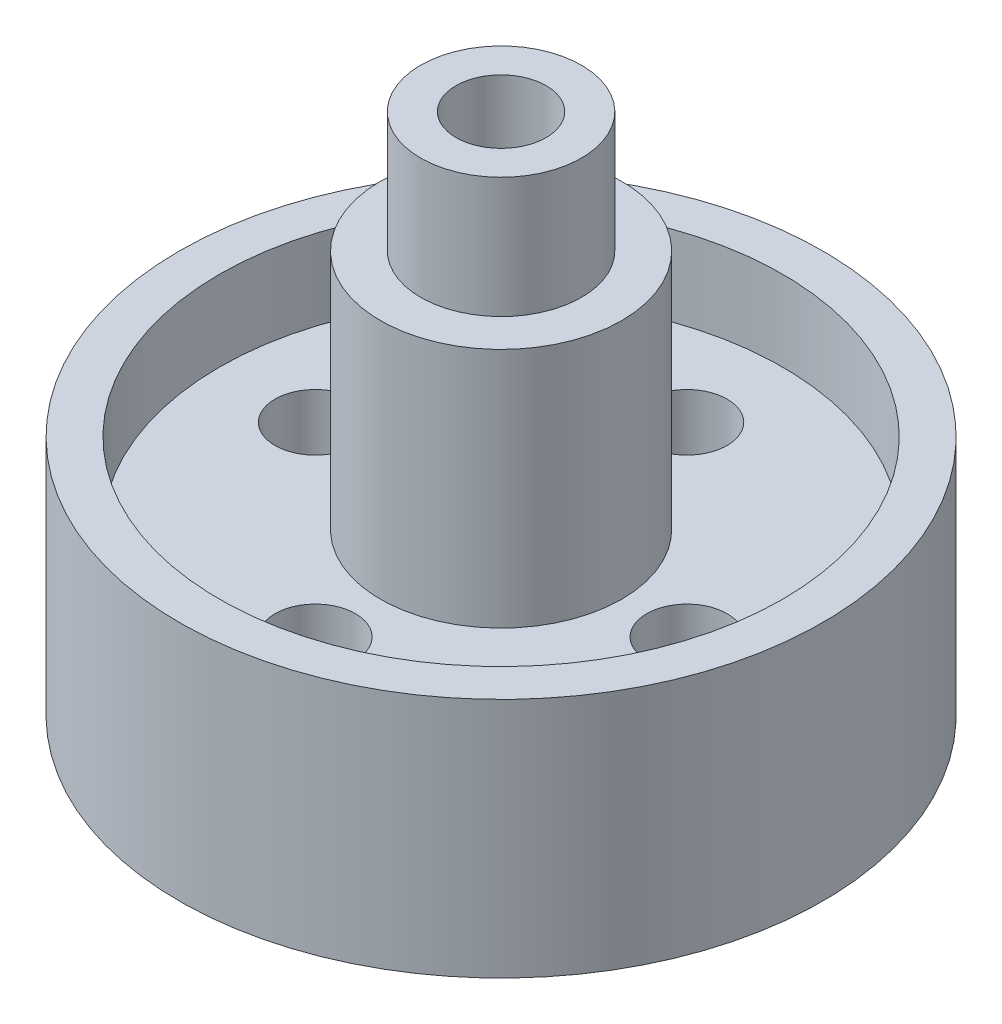
ISO-10303-21;
HEADER;
FILE_DESCRIPTION(('STEP AP214'),'2;1');
FILE_NAME('part.step','',(''),(''),'','','');
FILE_SCHEMA(('AUTOMOTIVE_DESIGN { 1 0 10303 214 1 1 1 1 }'));
ENDSEC;
DATA;
#1=APPLICATION_CONTEXT('core data for automotive mechanical design processes');
#2=APPLICATION_PROTOCOL_DEFINITION('international standard','automotive_design',2000,#1);
#3=PRODUCT_CONTEXT('',#1,'mechanical');
#4=PRODUCT('Part','Part','',(#3));
#5=PRODUCT_RELATED_PRODUCT_CATEGORY('part','',(#4));
#6=PRODUCT_DEFINITION_FORMATION('','',#4);
#7=PRODUCT_DEFINITION_CONTEXT('part definition',#1,'design');
#8=PRODUCT_DEFINITION('design','',#6,#7);
#9=PRODUCT_DEFINITION_SHAPE('','',#8);
#10=(LENGTH_UNIT() NAMED_UNIT(*) SI_UNIT(.MILLI.,.METRE.));
#11=(NAMED_UNIT(*) PLANE_ANGLE_UNIT() SI_UNIT($,.RADIAN.));
#12=(NAMED_UNIT(*) SI_UNIT($,.STERADIAN.) SOLID_ANGLE_UNIT());
#13=UNCERTAINTY_MEASURE_WITH_UNIT(LENGTH_MEASURE(1.E-05),#10,'distance_accuracy_value','');
#14=(GEOMETRIC_REPRESENTATION_CONTEXT(3) GLOBAL_UNCERTAINTY_ASSIGNED_CONTEXT((#13)) GLOBAL_UNIT_ASSIGNED_CONTEXT((#10,
#11,#12)) REPRESENTATION_CONTEXT('',''));
#15=CARTESIAN_POINT('',(0.,0.,0.));
#16=DIRECTION('',(0.,0.,1.));
#17=DIRECTION('',(1.,0.,0.));
#18=AXIS2_PLACEMENT_3D('',#15,#16,#17);
#19=CARTESIAN_POINT('',(50.8,25.4,0.));
#20=DIRECTION('',(0.,-1.,0.));
#21=DIRECTION('',(1.,0.,0.));
#22=AXIS2_PLACEMENT_3D('',#19,#20,#21);
#23=PLANE('',#22);
#24=CARTESIAN_POINT('',(0.,25.4,0.));
#25=DIRECTION('',(0.,-1.,0.));
#26=DIRECTION('',(1.,0.,0.));
#27=AXIS2_PLACEMENT_3D('',#24,#25,#26);
#28=CIRCLE('',#27,19.05);
#29=CARTESIAN_POINT('',(19.05,25.4,0.));
#30=VERTEX_POINT('',#29);
#31=EDGE_CURVE('E35',#30,#30,#28,.F.);
#32=ORIENTED_EDGE('',*,*,#31,.F.);
#33=EDGE_LOOP('',(#32));
#34=FACE_BOUND('',#33,.T.);
#35=CARTESIAN_POINT('',(3.07288764112923E-13,25.4,-29.337));
#36=DIRECTION('',(0.,1.,0.));
#37=DIRECTION('',(-1.,0.,0.));
#38=AXIS2_PLACEMENT_3D('',#35,#36,#37);
#39=CIRCLE('',#38,6.35);
#40=CARTESIAN_POINT('',(-6.3499999999997,25.4,-29.337));
#41=VERTEX_POINT('',#40);
#42=EDGE_CURVE('E60',#41,#41,#39,.T.);
#43=ORIENTED_EDGE('',*,*,#42,.F.);
#44=EDGE_LOOP('',(#43));
#45=FACE_BOUND('',#44,.T.);
#46=CARTESIAN_POINT('',(-29.337,25.4,-2.04859176075282E-13));
#47=DIRECTION('',(0.,1.,0.));
#48=DIRECTION('',(-1.,0.,0.));
#49=AXIS2_PLACEMENT_3D('',#46,#47,#48);
#50=CIRCLE('',#49,6.35);
#51=CARTESIAN_POINT('',(-35.687,25.4,-2.04859176075282E-13));
#52=VERTEX_POINT('',#51);
#53=EDGE_CURVE('E76',#52,#52,#50,.T.);
#54=ORIENTED_EDGE('',*,*,#53,.F.);
#55=EDGE_LOOP('',(#54));
#56=FACE_BOUND('',#55,.T.);
#57=CARTESIAN_POINT('',(-1.02429588037641E-13,25.4,29.337));
#58=DIRECTION('',(0.,1.,0.));
#59=DIRECTION('',(-1.,0.,0.));
#60=AXIS2_PLACEMENT_3D('',#57,#58,#59);
#61=CIRCLE('',#60,6.35);
#62=CARTESIAN_POINT('',(-6.3500000000001,25.4,29.337));
#63=VERTEX_POINT('',#62);
#64=EDGE_CURVE('E70',#63,#63,#61,.T.);
#65=ORIENTED_EDGE('',*,*,#64,.F.);
#66=EDGE_LOOP('',(#65));
#67=FACE_BOUND('',#66,.T.);
#68=CARTESIAN_POINT('',(29.337,25.4,0.));
#69=DIRECTION('',(0.,1.,0.));
#70=DIRECTION('',(-1.,0.,0.));
#71=AXIS2_PLACEMENT_3D('',#68,#69,#70);
#72=CIRCLE('',#71,6.35);
#73=CARTESIAN_POINT('',(22.987,25.4,0.));
#74=VERTEX_POINT('',#73);
#75=EDGE_CURVE('E64',#74,#74,#72,.T.);
#76=ORIENTED_EDGE('',*,*,#75,.F.);
#77=EDGE_LOOP('',(#76));
#78=FACE_BOUND('',#77,.T.);
#79=CARTESIAN_POINT('',(0.,25.4,0.));
#80=DIRECTION('',(0.,1.,0.));
#81=DIRECTION('',(-1.,0.,0.));
#82=AXIS2_PLACEMENT_3D('',#79,#80,#81);
#83=CIRCLE('',#82,44.45);
#84=CARTESIAN_POINT('',(-44.45,25.4,0.));
#85=VERTEX_POINT('',#84);
#86=EDGE_CURVE('E51',#85,#85,#83,.T.);
#87=ORIENTED_EDGE('',*,*,#86,.T.);
#88=EDGE_LOOP('',(#87));
#89=FACE_BOUND('',#88,.T.);
#90=ADVANCED_FACE('F31',(#34,#45,#56,#67,#78,#89),#23,.F.);
#91=CARTESIAN_POINT('',(0.,0.,0.));
#92=DIRECTION('',(0.,1.,0.));
#93=DIRECTION('',(-1.,0.,0.));
#94=AXIS2_PLACEMENT_3D('',#91,#92,#93);
#95=PLANE('',#94);
#96=CARTESIAN_POINT('',(0.,0.,0.));
#97=DIRECTION('',(0.,1.,0.));
#98=DIRECTION('',(-1.,0.,0.));
#99=AXIS2_PLACEMENT_3D('',#96,#97,#98);
#100=CIRCLE('',#99,7.112);
#101=CARTESIAN_POINT('',(-7.112,0.,0.));
#102=VERTEX_POINT('',#101);
#103=EDGE_CURVE('E101',#102,#102,#100,.T.);
#104=ORIENTED_EDGE('',*,*,#103,.T.);
#105=EDGE_LOOP('',(#104));
#106=FACE_BOUND('',#105,.T.);
#107=CARTESIAN_POINT('',(29.337,0.,0.));
#108=DIRECTION('',(0.,1.,0.));
#109=DIRECTION('',(-1.,0.,0.));
#110=AXIS2_PLACEMENT_3D('',#107,#108,#109);
#111=CIRCLE('',#110,6.35);
#112=CARTESIAN_POINT('',(22.987,0.,0.));
#113=VERTEX_POINT('',#112);
#114=EDGE_CURVE('E61',#113,#113,#111,.T.);
#115=ORIENTED_EDGE('',*,*,#114,.T.);
#116=EDGE_LOOP('',(#115));
#117=FACE_BOUND('',#116,.T.);
#118=CARTESIAN_POINT('',(-1.02429588037641E-13,0.,29.337));
#119=DIRECTION('',(0.,1.,0.));
#120=DIRECTION('',(-1.,0.,0.));
#121=AXIS2_PLACEMENT_3D('',#118,#119,#120);
#122=CIRCLE('',#121,6.35);
#123=CARTESIAN_POINT('',(-6.3500000000001,0.,29.337));
#124=VERTEX_POINT('',#123);
#125=EDGE_CURVE('E67',#124,#124,#122,.T.);
#126=ORIENTED_EDGE('',*,*,#125,.T.);
#127=EDGE_LOOP('',(#126));
#128=FACE_BOUND('',#127,.T.);
#129=CARTESIAN_POINT('',(-29.337,0.,-2.04859176075282E-13));
#130=DIRECTION('',(0.,1.,0.));
#131=DIRECTION('',(-1.,0.,0.));
#132=AXIS2_PLACEMENT_3D('',#129,#130,#131);
#133=CIRCLE('',#132,6.35);
#134=CARTESIAN_POINT('',(-35.687,0.,-2.04859176075282E-13));
#135=VERTEX_POINT('',#134);
#136=EDGE_CURVE('E73',#135,#135,#133,.T.);
#137=ORIENTED_EDGE('',*,*,#136,.T.);
#138=EDGE_LOOP('',(#137));
#139=FACE_BOUND('',#138,.T.);
#140=CARTESIAN_POINT('',(3.07288764112923E-13,0.,-29.337));
#141=DIRECTION('',(0.,1.,0.));
#142=DIRECTION('',(-1.,0.,0.));
#143=AXIS2_PLACEMENT_3D('',#140,#141,#142);
#144=CIRCLE('',#143,6.35);
#145=CARTESIAN_POINT('',(-6.3499999999997,0.,-29.337));
#146=VERTEX_POINT('',#145);
#147=EDGE_CURVE('E79',#146,#146,#144,.T.);
#148=ORIENTED_EDGE('',*,*,#147,.T.);
#149=EDGE_LOOP('',(#148));
#150=FACE_BOUND('',#149,.T.);
#151=CARTESIAN_POINT('',(0.,0.,0.));
#152=DIRECTION('',(0.,1.,0.));
#153=DIRECTION('',(-1.,0.,0.));
#154=AXIS2_PLACEMENT_3D('',#151,#152,#153);
#155=CIRCLE('',#154,50.8);
#156=CARTESIAN_POINT('',(-50.8,0.,0.));
#157=VERTEX_POINT('',#156);
#158=EDGE_CURVE('E43',#157,#157,#155,.T.);
#159=ORIENTED_EDGE('',*,*,#158,.F.);
#160=EDGE_LOOP('',(#159));
#161=FACE_BOUND('',#160,.T.);
#162=ADVANCED_FACE('F33',(#106,#117,#128,#139,#150,#161),#95,.F.);
#163=CARTESIAN_POINT('',(0.,25.4,0.));
#164=DIRECTION('',(0.,1.,0.));
#165=DIRECTION('',(-1.,0.,0.));
#166=AXIS2_PLACEMENT_3D('',#163,#164,#165);
#167=CYLINDRICAL_SURFACE('',#166,50.8);
#168=ORIENTED_EDGE('',*,*,#158,.T.);
#169=EDGE_LOOP('',(#168));
#170=FACE_BOUND('',#169,.T.);
#171=CARTESIAN_POINT('',(0.,38.1,0.));
#172=DIRECTION('',(0.,1.,0.));
#173=DIRECTION('',(-1.,0.,0.));
#174=AXIS2_PLACEMENT_3D('',#171,#172,#173);
#175=CIRCLE('',#174,50.8);
#176=CARTESIAN_POINT('',(-50.8,38.1,0.));
#177=VERTEX_POINT('',#176);
#178=EDGE_CURVE('E55',#177,#177,#175,.T.);
#179=ORIENTED_EDGE('',*,*,#178,.F.);
#180=EDGE_LOOP('',(#179));
#181=FACE_BOUND('',#180,.T.);
#182=ADVANCED_FACE('F86',(#170,#181),#167,.T.);
#183=CARTESIAN_POINT('',(3.07288764112923E-13,0.,-29.337));
#184=DIRECTION('',(0.,1.,0.));
#185=DIRECTION('',(-1.,0.,0.));
#186=AXIS2_PLACEMENT_3D('',#183,#184,#185);
#187=CYLINDRICAL_SURFACE('',#186,6.35);
#188=ORIENTED_EDGE('',*,*,#147,.F.);
#189=EDGE_LOOP('',(#188));
#190=FACE_BOUND('',#189,.T.);
#191=ORIENTED_EDGE('',*,*,#42,.T.);
#192=EDGE_LOOP('',(#191));
#193=FACE_BOUND('',#192,.T.);
#194=ADVANCED_FACE('F95',(#190,#193),#187,.F.);
#195=CARTESIAN_POINT('',(-29.337,0.,-2.04859176075282E-13));
#196=DIRECTION('',(0.,1.,0.));
#197=DIRECTION('',(-1.,0.,0.));
#198=AXIS2_PLACEMENT_3D('',#195,#196,#197);
#199=CYLINDRICAL_SURFACE('',#198,6.35);
#200=ORIENTED_EDGE('',*,*,#136,.F.);
#201=EDGE_LOOP('',(#200));
#202=FACE_BOUND('',#201,.T.);
#203=ORIENTED_EDGE('',*,*,#53,.T.);
#204=EDGE_LOOP('',(#203));
#205=FACE_BOUND('',#204,.T.);
#206=ADVANCED_FACE('F112',(#202,#205),#199,.F.);
#207=CARTESIAN_POINT('',(-1.02429588037641E-13,0.,29.337));
#208=DIRECTION('',(0.,1.,0.));
#209=DIRECTION('',(-1.,0.,0.));
#210=AXIS2_PLACEMENT_3D('',#207,#208,#209);
#211=CYLINDRICAL_SURFACE('',#210,6.35);
#212=ORIENTED_EDGE('',*,*,#125,.F.);
#213=EDGE_LOOP('',(#212));
#214=FACE_BOUND('',#213,.T.);
#215=ORIENTED_EDGE('',*,*,#64,.T.);
#216=EDGE_LOOP('',(#215));
#217=FACE_BOUND('',#216,.T.);
#218=ADVANCED_FACE('F145',(#214,#217),#211,.F.);
#219=CARTESIAN_POINT('',(29.337,0.,0.));
#220=DIRECTION('',(0.,1.,0.));
#221=DIRECTION('',(-1.,0.,0.));
#222=AXIS2_PLACEMENT_3D('',#219,#220,#221);
#223=CYLINDRICAL_SURFACE('',#222,6.35);
#224=ORIENTED_EDGE('',*,*,#114,.F.);
#225=EDGE_LOOP('',(#224));
#226=FACE_BOUND('',#225,.T.);
#227=ORIENTED_EDGE('',*,*,#75,.T.);
#228=EDGE_LOOP('',(#227));
#229=FACE_BOUND('',#228,.T.);
#230=ADVANCED_FACE('F138',(#226,#229),#223,.F.);
#231=CARTESIAN_POINT('',(0.,38.1,0.));
#232=DIRECTION('',(0.,1.,0.));
#233=DIRECTION('',(-1.,0.,0.));
#234=AXIS2_PLACEMENT_3D('',#231,#232,#233);
#235=PLANE('',#234);
#236=ORIENTED_EDGE('',*,*,#178,.T.);
#237=EDGE_LOOP('',(#236));
#238=FACE_BOUND('',#237,.T.);
#239=CARTESIAN_POINT('',(0.,38.1,0.));
#240=DIRECTION('',(0.,1.,0.));
#241=DIRECTION('',(-1.,0.,0.));
#242=AXIS2_PLACEMENT_3D('',#239,#240,#241);
#243=CIRCLE('',#242,44.45);
#244=CARTESIAN_POINT('',(-44.45,38.1,0.));
#245=VERTEX_POINT('',#244);
#246=EDGE_CURVE('E52',#245,#245,#243,.T.);
#247=ORIENTED_EDGE('',*,*,#246,.F.);
#248=EDGE_LOOP('',(#247));
#249=FACE_BOUND('',#248,.T.);
#250=ADVANCED_FACE('F128',(#238,#249),#235,.T.);
#251=CARTESIAN_POINT('',(0.,38.1,0.));
#252=DIRECTION('',(0.,-1.,0.));
#253=DIRECTION('',(1.,0.,0.));
#254=AXIS2_PLACEMENT_3D('',#251,#252,#253);
#255=CYLINDRICAL_SURFACE('',#254,44.45);
#256=ORIENTED_EDGE('',*,*,#246,.T.);
#257=EDGE_LOOP('',(#256));
#258=FACE_BOUND('',#257,.T.);
#259=ORIENTED_EDGE('',*,*,#86,.F.);
#260=EDGE_LOOP('',(#259));
#261=FACE_BOUND('',#260,.T.);
#262=ADVANCED_FACE('F125',(#258,#261),#255,.F.);
#263=CARTESIAN_POINT('',(0.,63.5,0.));
#264=DIRECTION('',(0.,-1.,0.));
#265=DIRECTION('',(1.,0.,0.));
#266=AXIS2_PLACEMENT_3D('',#263,#264,#265);
#267=CYLINDRICAL_SURFACE('',#266,19.05);
#268=CARTESIAN_POINT('',(0.,63.5,0.));
#269=DIRECTION('',(0.,1.,0.));
#270=DIRECTION('',(-1.,0.,0.));
#271=AXIS2_PLACEMENT_3D('',#268,#269,#270);
#272=CIRCLE('',#271,19.05);
#273=CARTESIAN_POINT('',(-19.05,63.5,0.));
#274=VERTEX_POINT('',#273);
#275=EDGE_CURVE('E48',#274,#274,#272,.T.);
#276=ORIENTED_EDGE('',*,*,#275,.F.);
#277=EDGE_LOOP('',(#276));
#278=FACE_BOUND('',#277,.T.);
#279=ORIENTED_EDGE('',*,*,#31,.T.);
#280=EDGE_LOOP('',(#279));
#281=FACE_BOUND('',#280,.T.);
#282=ADVANCED_FACE('F127',(#278,#281),#267,.T.);
#283=CARTESIAN_POINT('',(0.,63.5,0.));
#284=DIRECTION('',(0.,1.,0.));
#285=DIRECTION('',(-1.,0.,0.));
#286=AXIS2_PLACEMENT_3D('',#283,#284,#285);
#287=PLANE('',#286);
#288=CARTESIAN_POINT('',(0.,63.5,0.));
#289=DIRECTION('',(0.,1.,0.));
#290=DIRECTION('',(-1.,0.,0.));
#291=AXIS2_PLACEMENT_3D('',#288,#289,#290);
#292=CIRCLE('',#291,12.7);
#293=CARTESIAN_POINT('',(-12.7,63.5,0.));
#294=VERTEX_POINT('',#293);
#295=EDGE_CURVE('E10',#294,#294,#292,.T.);
#296=ORIENTED_EDGE('',*,*,#295,.F.);
#297=EDGE_LOOP('',(#296));
#298=FACE_BOUND('',#297,.T.);
#299=ORIENTED_EDGE('',*,*,#275,.T.);
#300=EDGE_LOOP('',(#299));
#301=FACE_BOUND('',#300,.T.);
#302=ADVANCED_FACE('F135',(#298,#301),#287,.T.);
#303=CARTESIAN_POINT('',(0.,82.55,0.));
#304=DIRECTION('',(0.,-1.,0.));
#305=DIRECTION('',(1.,0.,0.));
#306=AXIS2_PLACEMENT_3D('',#303,#304,#305);
#307=CYLINDRICAL_SURFACE('',#306,12.7);
#308=CARTESIAN_POINT('',(0.,82.55,0.));
#309=DIRECTION('',(0.,1.,0.));
#310=DIRECTION('',(-1.,0.,0.));
#311=AXIS2_PLACEMENT_3D('',#308,#309,#310);
#312=CIRCLE('',#311,12.7);
#313=CARTESIAN_POINT('',(-12.7,82.55,0.));
#314=VERTEX_POINT('',#313);
#315=EDGE_CURVE('E46',#314,#314,#312,.T.);
#316=ORIENTED_EDGE('',*,*,#315,.F.);
#317=EDGE_LOOP('',(#316));
#318=FACE_BOUND('',#317,.T.);
#319=ORIENTED_EDGE('',*,*,#295,.T.);
#320=EDGE_LOOP('',(#319));
#321=FACE_BOUND('',#320,.T.);
#322=ADVANCED_FACE('F197',(#318,#321),#307,.T.);
#323=CARTESIAN_POINT('',(0.,82.55,0.));
#324=DIRECTION('',(0.,1.,0.));
#325=DIRECTION('',(-1.,0.,0.));
#326=AXIS2_PLACEMENT_3D('',#323,#324,#325);
#327=PLANE('',#326);
#328=CARTESIAN_POINT('',(0.,82.55,0.));
#329=DIRECTION('',(0.,1.,0.));
#330=DIRECTION('',(-1.,0.,0.));
#331=AXIS2_PLACEMENT_3D('',#328,#329,#330);
#332=CIRCLE('',#331,7.112);
#333=CARTESIAN_POINT('',(-7.112,82.55,0.));
#334=VERTEX_POINT('',#333);
#335=EDGE_CURVE('E238',#334,#334,#332,.T.);
#336=ORIENTED_EDGE('',*,*,#335,.F.);
#337=EDGE_LOOP('',(#336));
#338=FACE_BOUND('',#337,.T.);
#339=ORIENTED_EDGE('',*,*,#315,.T.);
#340=EDGE_LOOP('',(#339));
#341=FACE_BOUND('',#340,.T.);
#342=ADVANCED_FACE('F205',(#338,#341),#327,.T.);
#343=CARTESIAN_POINT('',(0.,0.,0.));
#344=DIRECTION('',(0.,1.,0.));
#345=DIRECTION('',(-1.,0.,0.));
#346=AXIS2_PLACEMENT_3D('',#343,#344,#345);
#347=CYLINDRICAL_SURFACE('',#346,7.112);
#348=ORIENTED_EDGE('',*,*,#103,.F.);
#349=EDGE_LOOP('',(#348));
#350=FACE_BOUND('',#349,.T.);
#351=ORIENTED_EDGE('',*,*,#335,.T.);
#352=EDGE_LOOP('',(#351));
#353=FACE_BOUND('',#352,.T.);
#354=ADVANCED_FACE('F221',(#350,#353),#347,.F.);
#355=CLOSED_SHELL('',(#90,#162,#182,#194,#206,#218,#230,#250,#262,#282,#302,#322,#342,#354));
#356=MANIFOLD_SOLID_BREP('B2',#355);
#357=ADVANCED_BREP_SHAPE_REPRESENTATION('',(#18,#356),#14);
#358=SHAPE_DEFINITION_REPRESENTATION(#9,#357);
ENDSEC;
END-ISO-10303-21;
